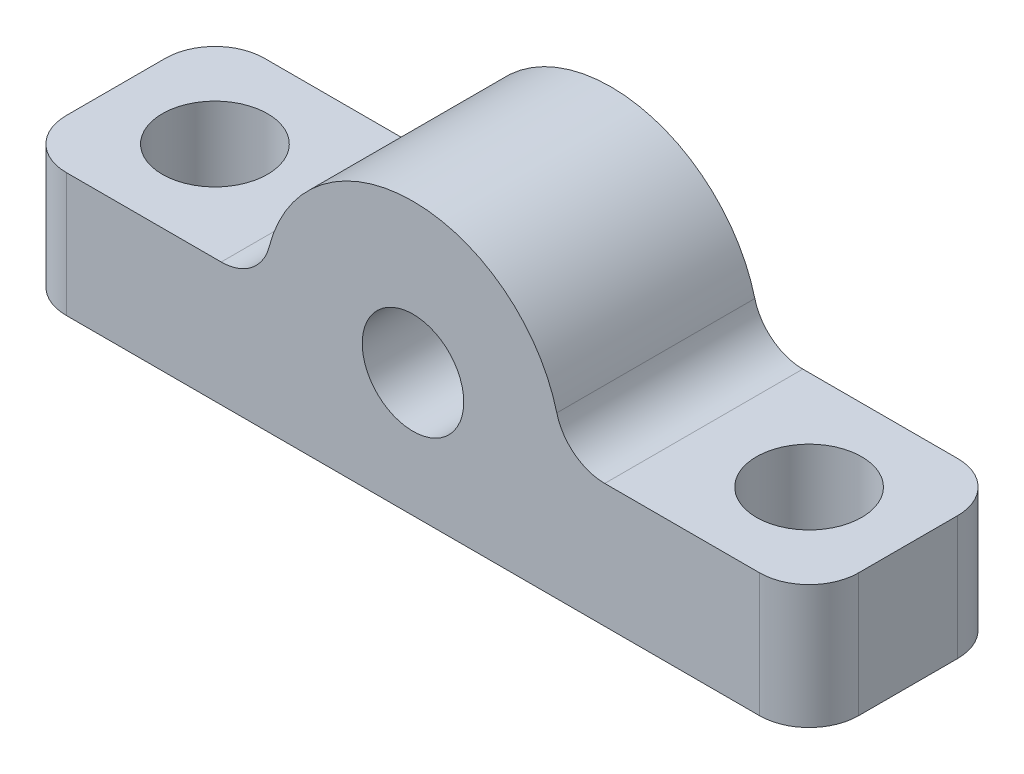
ISO-10303-21;
HEADER;
FILE_DESCRIPTION(('STEP AP214'),'2;1');
FILE_NAME('part.step','',(''),(''),'','','');
FILE_SCHEMA(('AUTOMOTIVE_DESIGN { 1 0 10303 214 1 1 1 1 }'));
ENDSEC;
DATA;
#1=APPLICATION_CONTEXT('core data for automotive mechanical design processes');
#2=APPLICATION_PROTOCOL_DEFINITION('international standard','automotive_design',2000,#1);
#3=PRODUCT_CONTEXT('',#1,'mechanical');
#4=PRODUCT('Part','Part','',(#3));
#5=PRODUCT_RELATED_PRODUCT_CATEGORY('part','',(#4));
#6=PRODUCT_DEFINITION_FORMATION('','',#4);
#7=PRODUCT_DEFINITION_CONTEXT('part definition',#1,'design');
#8=PRODUCT_DEFINITION('design','',#6,#7);
#9=PRODUCT_DEFINITION_SHAPE('','',#8);
#10=(LENGTH_UNIT() NAMED_UNIT(*) SI_UNIT(.MILLI.,.METRE.));
#11=(NAMED_UNIT(*) PLANE_ANGLE_UNIT() SI_UNIT($,.RADIAN.));
#12=(NAMED_UNIT(*) SI_UNIT($,.STERADIAN.) SOLID_ANGLE_UNIT());
#13=UNCERTAINTY_MEASURE_WITH_UNIT(LENGTH_MEASURE(1.E-05),#10,'distance_accuracy_value','');
#14=(GEOMETRIC_REPRESENTATION_CONTEXT(3) GLOBAL_UNCERTAINTY_ASSIGNED_CONTEXT((#13)) GLOBAL_UNIT_ASSIGNED_CONTEXT((#10,
#11,#12)) REPRESENTATION_CONTEXT('',''));
#15=CARTESIAN_POINT('',(0.,0.,0.));
#16=DIRECTION('',(0.,0.,1.));
#17=DIRECTION('',(1.,0.,0.));
#18=AXIS2_PLACEMENT_3D('',#15,#16,#17);
#19=CARTESIAN_POINT('',(0.,2.5,8.));
#20=DIRECTION('',(0.,0.,-1.));
#21=DIRECTION('',(-1.,0.,0.));
#22=AXIS2_PLACEMENT_3D('',#19,#20,#21);
#23=PLANE('',#22);
#24=DIRECTION('',(1.,0.,0.));
#25=VECTOR('',#24,1.);
#26=CARTESIAN_POINT('',(-16.,-2.5,8.));
#27=LINE('',#26,#25);
#28=CARTESIAN_POINT('',(-14.,-2.5,8.));
#29=VERTEX_POINT('',#28);
#30=CARTESIAN_POINT('',(14.,-2.5,8.));
#31=VERTEX_POINT('',#30);
#32=EDGE_CURVE('E222',#29,#31,#27,.T.);
#33=ORIENTED_EDGE('',*,*,#32,.T.);
#34=DIRECTION('',(0.,1.,0.));
#35=VECTOR('',#34,1.);
#36=CARTESIAN_POINT('',(14.,2.5,8.));
#37=LINE('',#36,#35);
#38=CARTESIAN_POINT('',(14.,2.5,8.));
#39=VERTEX_POINT('',#38);
#40=EDGE_CURVE('E171',#31,#39,#37,.T.);
#41=ORIENTED_EDGE('',*,*,#40,.T.);
#42=DIRECTION('',(-1.,0.,0.));
#43=VECTOR('',#42,1.);
#44=CARTESIAN_POINT('',(6.,2.5,8.));
#45=LINE('',#44,#43);
#46=CARTESIAN_POINT('',(7.74596669241483,2.5,8.));
#47=VERTEX_POINT('',#46);
#48=EDGE_CURVE('E128',#39,#47,#45,.T.);
#49=ORIENTED_EDGE('',*,*,#48,.T.);
#50=CARTESIAN_POINT('',(7.74596669241483,4.5,8.));
#51=DIRECTION('',(0.,0.,-1.));
#52=DIRECTION('',(-1.,0.,0.));
#53=AXIS2_PLACEMENT_3D('',#50,#51,#52);
#54=CIRCLE('',#53,2.);
#55=CARTESIAN_POINT('',(5.80947501931113,4.,8.));
#56=VERTEX_POINT('',#55);
#57=EDGE_CURVE('E190',#47,#56,#54,.T.);
#58=ORIENTED_EDGE('',*,*,#57,.T.);
#59=CARTESIAN_POINT('',(0.,2.5,8.));
#60=DIRECTION('',(0.,0.,1.));
#61=DIRECTION('',(-1.,0.,0.));
#62=AXIS2_PLACEMENT_3D('',#59,#60,#61);
#63=CIRCLE('',#62,6.);
#64=CARTESIAN_POINT('',(-5.80947501931113,4.,8.));
#65=VERTEX_POINT('',#64);
#66=EDGE_CURVE('E219',#56,#65,#63,.T.);
#67=ORIENTED_EDGE('',*,*,#66,.T.);
#68=CARTESIAN_POINT('',(-7.74596669241483,4.5,8.));
#69=DIRECTION('',(0.,0.,-1.));
#70=DIRECTION('',(-1.,0.,0.));
#71=AXIS2_PLACEMENT_3D('',#68,#69,#70);
#72=CIRCLE('',#71,2.);
#73=CARTESIAN_POINT('',(-7.74596669241484,2.5,8.));
#74=VERTEX_POINT('',#73);
#75=EDGE_CURVE('E11',#65,#74,#72,.T.);
#76=ORIENTED_EDGE('',*,*,#75,.T.);
#77=DIRECTION('',(-1.,0.,0.));
#78=VECTOR('',#77,1.);
#79=CARTESIAN_POINT('',(-16.,2.5,8.));
#80=LINE('',#79,#78);
#81=CARTESIAN_POINT('',(-14.,2.5,8.));
#82=VERTEX_POINT('',#81);
#83=EDGE_CURVE('E217',#74,#82,#80,.T.);
#84=ORIENTED_EDGE('',*,*,#83,.T.);
#85=DIRECTION('',(0.,-1.,0.));
#86=VECTOR('',#85,1.);
#87=CARTESIAN_POINT('',(-14.,2.5,8.));
#88=LINE('',#87,#86);
#89=EDGE_CURVE('E168',#82,#29,#88,.T.);
#90=ORIENTED_EDGE('',*,*,#89,.T.);
#91=EDGE_LOOP('',(#33,#41,#49,#58,#67,#76,#84,#90));
#92=FACE_BOUND('',#91,.T.);
#93=CARTESIAN_POINT('',(0.,2.5,8.));
#94=DIRECTION('',(0.,0.,1.));
#95=DIRECTION('',(1.,0.,0.));
#96=AXIS2_PLACEMENT_3D('',#93,#94,#95);
#97=CIRCLE('',#96,2.05);
#98=CARTESIAN_POINT('',(2.05,2.5,8.));
#99=VERTEX_POINT('',#98);
#100=EDGE_CURVE('E230',#99,#99,#97,.T.);
#101=ORIENTED_EDGE('',*,*,#100,.F.);
#102=EDGE_LOOP('',(#101));
#103=FACE_BOUND('',#102,.T.);
#104=ADVANCED_FACE('F33',(#92,#103),#23,.F.);
#105=CARTESIAN_POINT('',(0.,2.5,0.));
#106=DIRECTION('',(0.,0.,-1.));
#107=DIRECTION('',(-1.,0.,0.));
#108=AXIS2_PLACEMENT_3D('',#105,#106,#107);
#109=PLANE('',#108);
#110=DIRECTION('',(-1.,0.,0.));
#111=VECTOR('',#110,1.);
#112=CARTESIAN_POINT('',(6.,2.5,0.));
#113=LINE('',#112,#111);
#114=CARTESIAN_POINT('',(14.,2.5,0.));
#115=VERTEX_POINT('',#114);
#116=CARTESIAN_POINT('',(7.74596669241483,2.5,0.));
#117=VERTEX_POINT('',#116);
#118=EDGE_CURVE('E208',#115,#117,#113,.T.);
#119=ORIENTED_EDGE('',*,*,#118,.F.);
#120=DIRECTION('',(0.,1.,0.));
#121=VECTOR('',#120,1.);
#122=CARTESIAN_POINT('',(14.,-2.5,0.));
#123=LINE('',#122,#121);
#124=CARTESIAN_POINT('',(14.,-2.5,0.));
#125=VERTEX_POINT('',#124);
#126=EDGE_CURVE('E159',#115,#125,#123,.F.);
#127=ORIENTED_EDGE('',*,*,#126,.T.);
#128=DIRECTION('',(1.,0.,0.));
#129=VECTOR('',#128,1.);
#130=CARTESIAN_POINT('',(-16.,-2.5,0.));
#131=LINE('',#130,#129);
#132=CARTESIAN_POINT('',(-14.,-2.5,0.));
#133=VERTEX_POINT('',#132);
#134=EDGE_CURVE('E233',#133,#125,#131,.T.);
#135=ORIENTED_EDGE('',*,*,#134,.F.);
#136=DIRECTION('',(0.,-1.,0.));
#137=VECTOR('',#136,1.);
#138=CARTESIAN_POINT('',(-14.,2.5,0.));
#139=LINE('',#138,#137);
#140=CARTESIAN_POINT('',(-14.,2.5,0.));
#141=VERTEX_POINT('',#140);
#142=EDGE_CURVE('E157',#133,#141,#139,.F.);
#143=ORIENTED_EDGE('',*,*,#142,.T.);
#144=DIRECTION('',(-1.,0.,0.));
#145=VECTOR('',#144,1.);
#146=CARTESIAN_POINT('',(-16.,2.5,0.));
#147=LINE('',#146,#145);
#148=CARTESIAN_POINT('',(-7.74596669241484,2.5,0.));
#149=VERTEX_POINT('',#148);
#150=EDGE_CURVE('E199',#149,#141,#147,.T.);
#151=ORIENTED_EDGE('',*,*,#150,.F.);
#152=CARTESIAN_POINT('',(-7.74596669241483,4.5,0.));
#153=DIRECTION('',(0.,0.,-1.));
#154=DIRECTION('',(-1.,0.,0.));
#155=AXIS2_PLACEMENT_3D('',#152,#153,#154);
#156=CIRCLE('',#155,2.);
#157=CARTESIAN_POINT('',(-5.80947501931113,4.,0.));
#158=VERTEX_POINT('',#157);
#159=EDGE_CURVE('E41',#149,#158,#156,.F.);
#160=ORIENTED_EDGE('',*,*,#159,.T.);
#161=CARTESIAN_POINT('',(0.,2.5,0.));
#162=DIRECTION('',(0.,0.,1.));
#163=DIRECTION('',(-1.,0.,0.));
#164=AXIS2_PLACEMENT_3D('',#161,#162,#163);
#165=CIRCLE('',#164,6.);
#166=CARTESIAN_POINT('',(5.80947501931113,4.,0.));
#167=VERTEX_POINT('',#166);
#168=EDGE_CURVE('E198',#167,#158,#165,.T.);
#169=ORIENTED_EDGE('',*,*,#168,.F.);
#170=CARTESIAN_POINT('',(7.74596669241483,4.5,0.));
#171=DIRECTION('',(0.,0.,-1.));
#172=DIRECTION('',(-1.,0.,0.));
#173=AXIS2_PLACEMENT_3D('',#170,#171,#172);
#174=CIRCLE('',#173,2.);
#175=EDGE_CURVE('E188',#167,#117,#174,.F.);
#176=ORIENTED_EDGE('',*,*,#175,.T.);
#177=EDGE_LOOP('',(#119,#127,#135,#143,#151,#160,#169,#176));
#178=FACE_BOUND('',#177,.T.);
#179=CARTESIAN_POINT('',(0.,2.5,0.));
#180=DIRECTION('',(0.,0.,1.));
#181=DIRECTION('',(1.,0.,0.));
#182=AXIS2_PLACEMENT_3D('',#179,#180,#181);
#183=CIRCLE('',#182,2.05);
#184=CARTESIAN_POINT('',(2.05,2.5,0.));
#185=VERTEX_POINT('',#184);
#186=EDGE_CURVE('E246',#185,#185,#183,.T.);
#187=ORIENTED_EDGE('',*,*,#186,.T.);
#188=EDGE_LOOP('',(#187));
#189=FACE_BOUND('',#188,.T.);
#190=ADVANCED_FACE('F196',(#178,#189),#109,.T.);
#191=CARTESIAN_POINT('',(16.,-2.5,8.));
#192=DIRECTION('',(-1.,0.,0.));
#193=DIRECTION('',(0.,0.,1.));
#194=AXIS2_PLACEMENT_3D('',#191,#192,#193);
#195=PLANE('',#194);
#196=DIRECTION('',(0.,0.,-1.));
#197=VECTOR('',#196,1.);
#198=CARTESIAN_POINT('',(16.,-2.5,8.));
#199=LINE('',#198,#197);
#200=CARTESIAN_POINT('',(16.,-2.5,6.));
#201=VERTEX_POINT('',#200);
#202=CARTESIAN_POINT('',(16.,-2.5,2.));
#203=VERTEX_POINT('',#202);
#204=EDGE_CURVE('E224',#201,#203,#199,.T.);
#205=ORIENTED_EDGE('',*,*,#204,.T.);
#206=DIRECTION('',(0.,1.,0.));
#207=VECTOR('',#206,1.);
#208=CARTESIAN_POINT('',(16.,2.5,2.));
#209=LINE('',#208,#207);
#210=CARTESIAN_POINT('',(16.,2.5,2.));
#211=VERTEX_POINT('',#210);
#212=EDGE_CURVE('E143',#203,#211,#209,.T.);
#213=ORIENTED_EDGE('',*,*,#212,.T.);
#214=DIRECTION('',(0.,0.,-1.));
#215=VECTOR('',#214,1.);
#216=CARTESIAN_POINT('',(16.,2.5,8.));
#217=LINE('',#216,#215);
#218=CARTESIAN_POINT('',(16.,2.5,6.));
#219=VERTEX_POINT('',#218);
#220=EDGE_CURVE('E126',#219,#211,#217,.T.);
#221=ORIENTED_EDGE('',*,*,#220,.F.);
#222=DIRECTION('',(0.,1.,0.));
#223=VECTOR('',#222,1.);
#224=CARTESIAN_POINT('',(16.,-2.5,6.));
#225=LINE('',#224,#223);
#226=EDGE_CURVE('E140',#219,#201,#225,.F.);
#227=ORIENTED_EDGE('',*,*,#226,.T.);
#228=EDGE_LOOP('',(#205,#213,#221,#227));
#229=FACE_BOUND('',#228,.T.);
#230=ADVANCED_FACE('F139',(#229),#195,.F.);
#231=CARTESIAN_POINT('',(6.,2.5,8.));
#232=DIRECTION('',(0.,-1.,0.));
#233=DIRECTION('',(1.,0.,0.));
#234=AXIS2_PLACEMENT_3D('',#231,#232,#233);
#235=PLANE('',#234);
#236=CARTESIAN_POINT('',(12.,2.5,4.));
#237=DIRECTION('',(0.,1.,0.));
#238=DIRECTION('',(0.,0.,1.));
#239=AXIS2_PLACEMENT_3D('',#236,#237,#238);
#240=CIRCLE('',#239,2.125);
#241=CARTESIAN_POINT('',(12.,2.5,6.125));
#242=VERTEX_POINT('',#241);
#243=EDGE_CURVE('E242',#242,#242,#240,.T.);
#244=ORIENTED_EDGE('',*,*,#243,.F.);
#245=EDGE_LOOP('',(#244));
#246=FACE_BOUND('',#245,.T.);
#247=ORIENTED_EDGE('',*,*,#220,.T.);
#248=CARTESIAN_POINT('',(14.,2.5,2.));
#249=DIRECTION('',(0.,-1.,0.));
#250=DIRECTION('',(1.,0.,0.));
#251=AXIS2_PLACEMENT_3D('',#248,#249,#250);
#252=CIRCLE('',#251,2.);
#253=EDGE_CURVE('E133',#211,#115,#252,.F.);
#254=ORIENTED_EDGE('',*,*,#253,.T.);
#255=ORIENTED_EDGE('',*,*,#118,.T.);
#256=DIRECTION('',(0.,0.,1.));
#257=VECTOR('',#256,1.);
#258=CARTESIAN_POINT('',(7.74596669241483,2.5,8.));
#259=LINE('',#258,#257);
#260=EDGE_CURVE('E134',#117,#47,#259,.T.);
#261=ORIENTED_EDGE('',*,*,#260,.T.);
#262=ORIENTED_EDGE('',*,*,#48,.F.);
#263=CARTESIAN_POINT('',(14.,2.5,6.));
#264=DIRECTION('',(0.,-1.,0.));
#265=DIRECTION('',(1.,0.,0.));
#266=AXIS2_PLACEMENT_3D('',#263,#264,#265);
#267=CIRCLE('',#266,2.);
#268=EDGE_CURVE('E123',#39,#219,#267,.F.);
#269=ORIENTED_EDGE('',*,*,#268,.T.);
#270=EDGE_LOOP('',(#247,#254,#255,#261,#262,#269));
#271=FACE_BOUND('',#270,.T.);
#272=ADVANCED_FACE('F125',(#246,#271),#235,.F.);
#273=CARTESIAN_POINT('',(0.,2.5,8.));
#274=DIRECTION('',(0.,0.,-1.));
#275=DIRECTION('',(-1.,0.,0.));
#276=AXIS2_PLACEMENT_3D('',#273,#274,#275);
#277=CYLINDRICAL_SURFACE('',#276,6.);
#278=ORIENTED_EDGE('',*,*,#66,.F.);
#279=DIRECTION('',(0.,0.,-1.));
#280=VECTOR('',#279,1.);
#281=CARTESIAN_POINT('',(5.80947501931113,4.,8.));
#282=LINE('',#281,#280);
#283=EDGE_CURVE('E175',#56,#167,#282,.T.);
#284=ORIENTED_EDGE('',*,*,#283,.T.);
#285=ORIENTED_EDGE('',*,*,#168,.T.);
#286=DIRECTION('',(0.,0.,-1.));
#287=VECTOR('',#286,1.);
#288=CARTESIAN_POINT('',(-5.80947501931113,4.,8.));
#289=LINE('',#288,#287);
#290=EDGE_CURVE('E173',#158,#65,#289,.F.);
#291=ORIENTED_EDGE('',*,*,#290,.T.);
#292=EDGE_LOOP('',(#278,#284,#285,#291));
#293=FACE_BOUND('',#292,.T.);
#294=ADVANCED_FACE('F205',(#293),#277,.T.);
#295=CARTESIAN_POINT('',(-16.,2.5,8.));
#296=DIRECTION('',(0.,-1.,0.));
#297=DIRECTION('',(1.,0.,0.));
#298=AXIS2_PLACEMENT_3D('',#295,#296,#297);
#299=PLANE('',#298);
#300=CARTESIAN_POINT('',(-12.,2.5,4.));
#301=DIRECTION('',(0.,1.,0.));
#302=DIRECTION('',(0.,0.,1.));
#303=AXIS2_PLACEMENT_3D('',#300,#301,#302);
#304=CIRCLE('',#303,2.125);
#305=CARTESIAN_POINT('',(-12.,2.5,6.125));
#306=VERTEX_POINT('',#305);
#307=EDGE_CURVE('E248',#306,#306,#304,.T.);
#308=ORIENTED_EDGE('',*,*,#307,.F.);
#309=EDGE_LOOP('',(#308));
#310=FACE_BOUND('',#309,.T.);
#311=ORIENTED_EDGE('',*,*,#83,.F.);
#312=DIRECTION('',(0.,0.,1.));
#313=VECTOR('',#312,1.);
#314=CARTESIAN_POINT('',(-7.74596669241483,2.5,0.));
#315=LINE('',#314,#313);
#316=EDGE_CURVE('E181',#74,#149,#315,.F.);
#317=ORIENTED_EDGE('',*,*,#316,.T.);
#318=ORIENTED_EDGE('',*,*,#150,.T.);
#319=CARTESIAN_POINT('',(-14.,2.5,2.));
#320=DIRECTION('',(0.,-1.,0.));
#321=DIRECTION('',(1.,0.,0.));
#322=AXIS2_PLACEMENT_3D('',#319,#320,#321);
#323=CIRCLE('',#322,2.);
#324=CARTESIAN_POINT('',(-16.,2.5,2.));
#325=VERTEX_POINT('',#324);
#326=EDGE_CURVE('E48',#141,#325,#323,.F.);
#327=ORIENTED_EDGE('',*,*,#326,.T.);
#328=DIRECTION('',(0.,0.,-1.));
#329=VECTOR('',#328,1.);
#330=CARTESIAN_POINT('',(-16.,2.5,8.));
#331=LINE('',#330,#329);
#332=CARTESIAN_POINT('',(-16.,2.5,6.));
#333=VERTEX_POINT('',#332);
#334=EDGE_CURVE('E144',#333,#325,#331,.T.);
#335=ORIENTED_EDGE('',*,*,#334,.F.);
#336=CARTESIAN_POINT('',(-14.,2.5,6.));
#337=DIRECTION('',(0.,-1.,0.));
#338=DIRECTION('',(1.,0.,0.));
#339=AXIS2_PLACEMENT_3D('',#336,#337,#338);
#340=CIRCLE('',#339,2.);
#341=EDGE_CURVE('E178',#333,#82,#340,.F.);
#342=ORIENTED_EDGE('',*,*,#341,.T.);
#343=EDGE_LOOP('',(#311,#317,#318,#327,#335,#342));
#344=FACE_BOUND('',#343,.T.);
#345=ADVANCED_FACE('F220',(#310,#344),#299,.F.);
#346=CARTESIAN_POINT('',(-16.,-2.5,8.));
#347=DIRECTION('',(1.,0.,0.));
#348=DIRECTION('',(0.,0.,-1.));
#349=AXIS2_PLACEMENT_3D('',#346,#347,#348);
#350=PLANE('',#349);
#351=ORIENTED_EDGE('',*,*,#334,.T.);
#352=DIRECTION('',(0.,-1.,0.));
#353=VECTOR('',#352,1.);
#354=CARTESIAN_POINT('',(-16.,-2.5,2.));
#355=LINE('',#354,#353);
#356=CARTESIAN_POINT('',(-16.,-2.5,2.));
#357=VERTEX_POINT('',#356);
#358=EDGE_CURVE('E185',#325,#357,#355,.T.);
#359=ORIENTED_EDGE('',*,*,#358,.T.);
#360=DIRECTION('',(0.,0.,-1.));
#361=VECTOR('',#360,1.);
#362=CARTESIAN_POINT('',(-16.,-2.5,8.));
#363=LINE('',#362,#361);
#364=CARTESIAN_POINT('',(-16.,-2.5,6.));
#365=VERTEX_POINT('',#364);
#366=EDGE_CURVE('E237',#365,#357,#363,.T.);
#367=ORIENTED_EDGE('',*,*,#366,.F.);
#368=DIRECTION('',(0.,-1.,0.));
#369=VECTOR('',#368,1.);
#370=CARTESIAN_POINT('',(-16.,-2.5,6.));
#371=LINE('',#370,#369);
#372=EDGE_CURVE('E55',#365,#333,#371,.F.);
#373=ORIENTED_EDGE('',*,*,#372,.T.);
#374=EDGE_LOOP('',(#351,#359,#367,#373));
#375=FACE_BOUND('',#374,.T.);
#376=ADVANCED_FACE('F273',(#375),#350,.F.);
#377=CARTESIAN_POINT('',(-16.,-2.5,8.));
#378=DIRECTION('',(0.,1.,0.));
#379=DIRECTION('',(0.,0.,1.));
#380=AXIS2_PLACEMENT_3D('',#377,#378,#379);
#381=PLANE('',#380);
#382=CARTESIAN_POINT('',(12.,-2.5,4.));
#383=DIRECTION('',(0.,1.,0.));
#384=DIRECTION('',(0.,0.,1.));
#385=AXIS2_PLACEMENT_3D('',#382,#383,#384);
#386=CIRCLE('',#385,2.125);
#387=CARTESIAN_POINT('',(12.,-2.5,6.125));
#388=VERTEX_POINT('',#387);
#389=EDGE_CURVE('E152',#388,#388,#386,.T.);
#390=ORIENTED_EDGE('',*,*,#389,.T.);
#391=EDGE_LOOP('',(#390));
#392=FACE_BOUND('',#391,.T.);
#393=CARTESIAN_POINT('',(-12.,-2.5,4.));
#394=DIRECTION('',(0.,1.,0.));
#395=DIRECTION('',(0.,0.,1.));
#396=AXIS2_PLACEMENT_3D('',#393,#394,#395);
#397=CIRCLE('',#396,2.125);
#398=CARTESIAN_POINT('',(-12.,-2.5,6.125));
#399=VERTEX_POINT('',#398);
#400=EDGE_CURVE('E240',#399,#399,#397,.T.);
#401=ORIENTED_EDGE('',*,*,#400,.T.);
#402=EDGE_LOOP('',(#401));
#403=FACE_BOUND('',#402,.T.);
#404=ORIENTED_EDGE('',*,*,#134,.T.);
#405=CARTESIAN_POINT('',(14.,-2.5,2.));
#406=DIRECTION('',(0.,1.,0.));
#407=DIRECTION('',(0.,0.,1.));
#408=AXIS2_PLACEMENT_3D('',#405,#406,#407);
#409=CIRCLE('',#408,2.);
#410=EDGE_CURVE('E166',#125,#203,#409,.F.);
#411=ORIENTED_EDGE('',*,*,#410,.T.);
#412=ORIENTED_EDGE('',*,*,#204,.F.);
#413=CARTESIAN_POINT('',(14.,-2.5,6.));
#414=DIRECTION('',(0.,1.,0.));
#415=DIRECTION('',(0.,0.,1.));
#416=AXIS2_PLACEMENT_3D('',#413,#414,#415);
#417=CIRCLE('',#416,2.);
#418=EDGE_CURVE('E148',#201,#31,#417,.F.);
#419=ORIENTED_EDGE('',*,*,#418,.T.);
#420=ORIENTED_EDGE('',*,*,#32,.F.);
#421=CARTESIAN_POINT('',(-14.,-2.5,6.));
#422=DIRECTION('',(0.,1.,0.));
#423=DIRECTION('',(0.,0.,1.));
#424=AXIS2_PLACEMENT_3D('',#421,#422,#423);
#425=CIRCLE('',#424,2.);
#426=EDGE_CURVE('E161',#29,#365,#425,.F.);
#427=ORIENTED_EDGE('',*,*,#426,.T.);
#428=ORIENTED_EDGE('',*,*,#366,.T.);
#429=CARTESIAN_POINT('',(-14.,-2.5,2.));
#430=DIRECTION('',(0.,1.,0.));
#431=DIRECTION('',(0.,0.,1.));
#432=AXIS2_PLACEMENT_3D('',#429,#430,#431);
#433=CIRCLE('',#432,2.);
#434=EDGE_CURVE('E163',#357,#133,#433,.F.);
#435=ORIENTED_EDGE('',*,*,#434,.T.);
#436=EDGE_LOOP('',(#404,#411,#412,#419,#420,#427,#428,#435));
#437=FACE_BOUND('',#436,.T.);
#438=ADVANCED_FACE('F269',(#392,#403,#437),#381,.F.);
#439=CARTESIAN_POINT('',(0.,2.5,8.));
#440=DIRECTION('',(0.,0.,-1.));
#441=DIRECTION('',(-1.,0.,0.));
#442=AXIS2_PLACEMENT_3D('',#439,#440,#441);
#443=CYLINDRICAL_SURFACE('',#442,2.05);
#444=ORIENTED_EDGE('',*,*,#100,.T.);
#445=EDGE_LOOP('',(#444));
#446=FACE_BOUND('',#445,.T.);
#447=ORIENTED_EDGE('',*,*,#186,.F.);
#448=EDGE_LOOP('',(#447));
#449=FACE_BOUND('',#448,.T.);
#450=ADVANCED_FACE('F287',(#446,#449),#443,.F.);
#451=CARTESIAN_POINT('',(-12.,-5.5,4.));
#452=DIRECTION('',(0.,1.,0.));
#453=DIRECTION('',(0.,0.,1.));
#454=AXIS2_PLACEMENT_3D('',#451,#452,#453);
#455=CYLINDRICAL_SURFACE('',#454,2.125);
#456=ORIENTED_EDGE('',*,*,#307,.T.);
#457=EDGE_LOOP('',(#456));
#458=FACE_BOUND('',#457,.T.);
#459=ORIENTED_EDGE('',*,*,#400,.F.);
#460=EDGE_LOOP('',(#459));
#461=FACE_BOUND('',#460,.T.);
#462=ADVANCED_FACE('F352',(#458,#461),#455,.F.);
#463=CARTESIAN_POINT('',(12.,-5.5,4.));
#464=DIRECTION('',(0.,1.,0.));
#465=DIRECTION('',(0.,0.,1.));
#466=AXIS2_PLACEMENT_3D('',#463,#464,#465);
#467=CYLINDRICAL_SURFACE('',#466,2.125);
#468=ORIENTED_EDGE('',*,*,#243,.T.);
#469=EDGE_LOOP('',(#468));
#470=FACE_BOUND('',#469,.T.);
#471=ORIENTED_EDGE('',*,*,#389,.F.);
#472=EDGE_LOOP('',(#471));
#473=FACE_BOUND('',#472,.T.);
#474=ADVANCED_FACE('F307',(#470,#473),#467,.F.);
#475=CARTESIAN_POINT('',(14.,-2.5,2.));
#476=DIRECTION('',(0.,-1.,0.));
#477=DIRECTION('',(0.,0.,-1.));
#478=AXIS2_PLACEMENT_3D('',#475,#476,#477);
#479=CYLINDRICAL_SURFACE('',#478,2.);
#480=ORIENTED_EDGE('',*,*,#410,.F.);
#481=ORIENTED_EDGE('',*,*,#126,.F.);
#482=ORIENTED_EDGE('',*,*,#253,.F.);
#483=ORIENTED_EDGE('',*,*,#212,.F.);
#484=EDGE_LOOP('',(#480,#481,#482,#483));
#485=FACE_BOUND('',#484,.T.);
#486=ADVANCED_FACE('F265',(#485),#479,.T.);
#487=CARTESIAN_POINT('',(14.,2.5,6.));
#488=DIRECTION('',(0.,1.,0.));
#489=DIRECTION('',(0.,0.,1.));
#490=AXIS2_PLACEMENT_3D('',#487,#488,#489);
#491=CYLINDRICAL_SURFACE('',#490,2.);
#492=ORIENTED_EDGE('',*,*,#418,.F.);
#493=ORIENTED_EDGE('',*,*,#226,.F.);
#494=ORIENTED_EDGE('',*,*,#268,.F.);
#495=ORIENTED_EDGE('',*,*,#40,.F.);
#496=EDGE_LOOP('',(#492,#493,#494,#495));
#497=FACE_BOUND('',#496,.T.);
#498=ADVANCED_FACE('F147',(#497),#491,.T.);
#499=CARTESIAN_POINT('',(7.74596669241483,4.5,8.));
#500=DIRECTION('',(0.,0.,-1.));
#501=DIRECTION('',(-1.,0.,0.));
#502=AXIS2_PLACEMENT_3D('',#499,#500,#501);
#503=CYLINDRICAL_SURFACE('',#502,2.);
#504=ORIENTED_EDGE('',*,*,#57,.F.);
#505=ORIENTED_EDGE('',*,*,#260,.F.);
#506=ORIENTED_EDGE('',*,*,#175,.F.);
#507=ORIENTED_EDGE('',*,*,#283,.F.);
#508=EDGE_LOOP('',(#504,#505,#506,#507));
#509=FACE_BOUND('',#508,.T.);
#510=ADVANCED_FACE('F261',(#509),#503,.F.);
#511=CARTESIAN_POINT('',(-7.74596669241483,4.5,8.));
#512=DIRECTION('',(0.,0.,-1.));
#513=DIRECTION('',(-1.,0.,0.));
#514=AXIS2_PLACEMENT_3D('',#511,#512,#513);
#515=CYLINDRICAL_SURFACE('',#514,2.);
#516=ORIENTED_EDGE('',*,*,#75,.F.);
#517=ORIENTED_EDGE('',*,*,#290,.F.);
#518=ORIENTED_EDGE('',*,*,#159,.F.);
#519=ORIENTED_EDGE('',*,*,#316,.F.);
#520=EDGE_LOOP('',(#516,#517,#518,#519));
#521=FACE_BOUND('',#520,.T.);
#522=ADVANCED_FACE('F211',(#521),#515,.F.);
#523=CARTESIAN_POINT('',(-14.,-2.5,2.));
#524=DIRECTION('',(0.,1.,0.));
#525=DIRECTION('',(0.,0.,1.));
#526=AXIS2_PLACEMENT_3D('',#523,#524,#525);
#527=CYLINDRICAL_SURFACE('',#526,2.);
#528=ORIENTED_EDGE('',*,*,#326,.F.);
#529=ORIENTED_EDGE('',*,*,#142,.F.);
#530=ORIENTED_EDGE('',*,*,#434,.F.);
#531=ORIENTED_EDGE('',*,*,#358,.F.);
#532=EDGE_LOOP('',(#528,#529,#530,#531));
#533=FACE_BOUND('',#532,.T.);
#534=ADVANCED_FACE('F272',(#533),#527,.T.);
#535=CARTESIAN_POINT('',(-14.,2.5,6.));
#536=DIRECTION('',(0.,-1.,0.));
#537=DIRECTION('',(0.,0.,-1.));
#538=AXIS2_PLACEMENT_3D('',#535,#536,#537);
#539=CYLINDRICAL_SURFACE('',#538,2.);
#540=ORIENTED_EDGE('',*,*,#341,.F.);
#541=ORIENTED_EDGE('',*,*,#372,.F.);
#542=ORIENTED_EDGE('',*,*,#426,.F.);
#543=ORIENTED_EDGE('',*,*,#89,.F.);
#544=EDGE_LOOP('',(#540,#541,#542,#543));
#545=FACE_BOUND('',#544,.T.);
#546=ADVANCED_FACE('F35',(#545),#539,.T.);
#547=CLOSED_SHELL('',(#104,#190,#230,#272,#294,#345,#376,#438,#450,#462,#474,#486,#498,#510,
#522,#534,#546));
#548=MANIFOLD_SOLID_BREP('B2',#547);
#549=ADVANCED_BREP_SHAPE_REPRESENTATION('',(#18,#548),#14);
#550=SHAPE_DEFINITION_REPRESENTATION(#9,#549);
ENDSEC;
END-ISO-10303-21;
